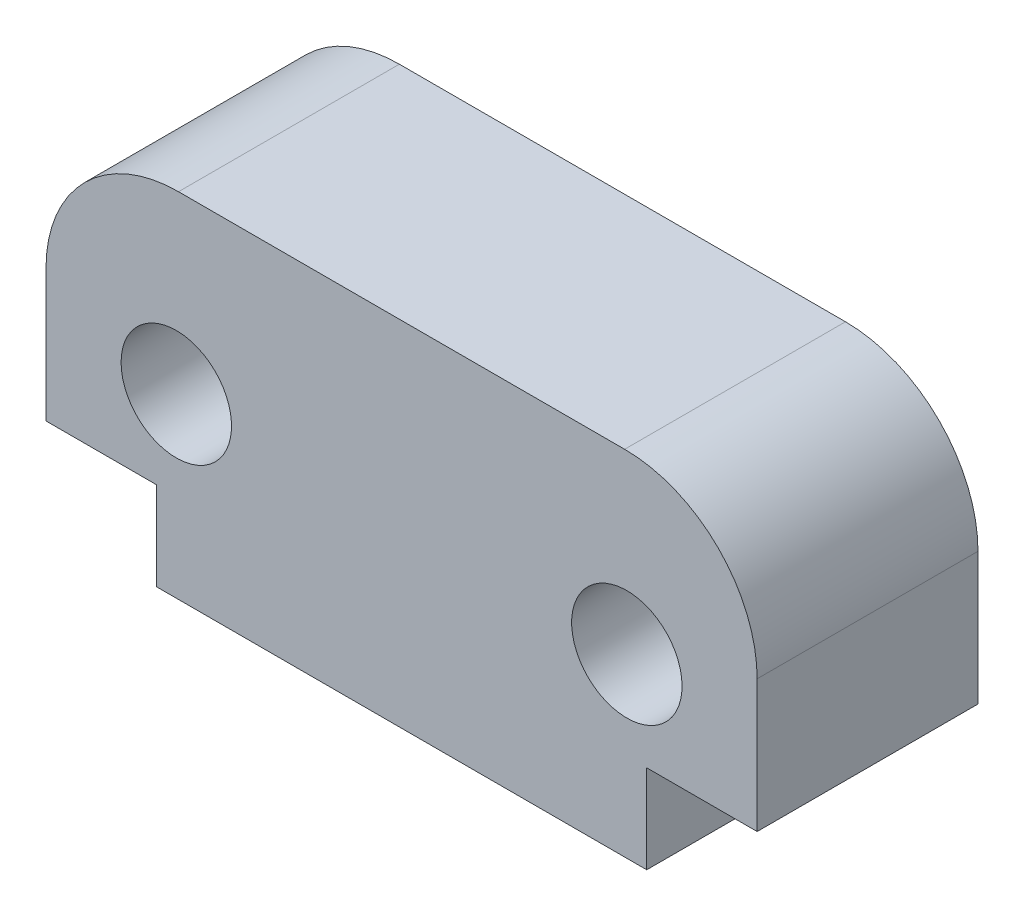
ISO-10303-21;
HEADER;
FILE_DESCRIPTION(('STEP AP214'),'2;1');
FILE_NAME('part.step','',(''),(''),'','','');
FILE_SCHEMA(('AUTOMOTIVE_DESIGN { 1 0 10303 214 1 1 1 1 }'));
ENDSEC;
DATA;
#1=APPLICATION_CONTEXT('core data for automotive mechanical design processes');
#2=APPLICATION_PROTOCOL_DEFINITION('international standard','automotive_design',2000,#1);
#3=PRODUCT_CONTEXT('',#1,'mechanical');
#4=PRODUCT('Part','Part','',(#3));
#5=PRODUCT_RELATED_PRODUCT_CATEGORY('part','',(#4));
#6=PRODUCT_DEFINITION_FORMATION('','',#4);
#7=PRODUCT_DEFINITION_CONTEXT('part definition',#1,'design');
#8=PRODUCT_DEFINITION('design','',#6,#7);
#9=PRODUCT_DEFINITION_SHAPE('','',#8);
#10=(LENGTH_UNIT() NAMED_UNIT(*) SI_UNIT(.MILLI.,.METRE.));
#11=(NAMED_UNIT(*) PLANE_ANGLE_UNIT() SI_UNIT($,.RADIAN.));
#12=(NAMED_UNIT(*) SI_UNIT($,.STERADIAN.) SOLID_ANGLE_UNIT());
#13=UNCERTAINTY_MEASURE_WITH_UNIT(LENGTH_MEASURE(1.E-05),#10,'distance_accuracy_value','');
#14=(GEOMETRIC_REPRESENTATION_CONTEXT(3) GLOBAL_UNCERTAINTY_ASSIGNED_CONTEXT((#13)) GLOBAL_UNIT_ASSIGNED_CONTEXT((#10,
#11,#12)) REPRESENTATION_CONTEXT('',''));
#15=CARTESIAN_POINT('',(0.,0.,0.));
#16=DIRECTION('',(0.,0.,1.));
#17=DIRECTION('',(1.,0.,0.));
#18=AXIS2_PLACEMENT_3D('',#15,#16,#17);
#19=CARTESIAN_POINT('',(0.500000000000054,4.99516954778732,5.));
#20=DIRECTION('',(0.,0.,-1.));
#21=DIRECTION('',(-1.,0.,0.));
#22=AXIS2_PLACEMENT_3D('',#19,#20,#21);
#23=PLANE('',#22);
#24=DIRECTION('',(0.,-1.,0.));
#25=VECTOR('',#24,1.);
#26=CARTESIAN_POINT('',(-2.49999999999995,2.00000000000051,5.));
#27=LINE('',#26,#25);
#28=CARTESIAN_POINT('',(-2.49999999999995,4.99516954778729,5.));
#29=VERTEX_POINT('',#28);
#30=CARTESIAN_POINT('',(-2.49999999999995,2.00000000000051,5.));
#31=VERTEX_POINT('',#30);
#32=EDGE_CURVE('E160',#29,#31,#27,.T.);
#33=ORIENTED_EDGE('',*,*,#32,.T.);
#34=DIRECTION('',(1.,0.,0.));
#35=VECTOR('',#34,1.);
#36=CARTESIAN_POINT('',(-4.02889527295613E-12,2.00000000000051,5.));
#37=LINE('',#36,#35);
#38=CARTESIAN_POINT('',(-4.02889527295613E-12,2.00000000000051,5.));
#39=VERTEX_POINT('',#38);
#40=EDGE_CURVE('E98',#31,#39,#37,.T.);
#41=ORIENTED_EDGE('',*,*,#40,.T.);
#42=DIRECTION('',(0.,-1.,0.));
#43=VECTOR('',#42,1.);
#44=CARTESIAN_POINT('',(-4.02889527295613E-12,2.00000000000051,5.));
#45=LINE('',#44,#43);
#46=CARTESIAN_POINT('',(-4.0286503435963E-12,-1.59594559789866E-13,5.));
#47=VERTEX_POINT('',#46);
#48=EDGE_CURVE('E181',#39,#47,#45,.T.);
#49=ORIENTED_EDGE('',*,*,#48,.T.);
#50=DIRECTION('',(1.,0.,0.));
#51=VECTOR('',#50,1.);
#52=CARTESIAN_POINT('',(-4.0286503435963E-12,-1.59594559789866E-13,5.));
#53=LINE('',#52,#51);
#54=CARTESIAN_POINT('',(11.1000000000043,-1.60798751300019E-13,5.));
#55=VERTEX_POINT('',#54);
#56=EDGE_CURVE('E200',#47,#55,#53,.T.);
#57=ORIENTED_EDGE('',*,*,#56,.T.);
#58=DIRECTION('',(0.,1.,0.));
#59=VECTOR('',#58,1.);
#60=CARTESIAN_POINT('',(11.1000000000043,2.00000000000051,5.));
#61=LINE('',#60,#59);
#62=CARTESIAN_POINT('',(11.1000000000043,2.00000000000051,5.));
#63=VERTEX_POINT('',#62);
#64=EDGE_CURVE('E197',#55,#63,#61,.T.);
#65=ORIENTED_EDGE('',*,*,#64,.T.);
#66=DIRECTION('',(1.,0.,0.));
#67=VECTOR('',#66,1.);
#68=CARTESIAN_POINT('',(11.1000000000043,2.00000000000051,5.));
#69=LINE('',#68,#67);
#70=CARTESIAN_POINT('',(13.6000000000002,2.00000000000051,5.));
#71=VERTEX_POINT('',#70);
#72=EDGE_CURVE('E199',#63,#71,#69,.T.);
#73=ORIENTED_EDGE('',*,*,#72,.T.);
#74=DIRECTION('',(0.,1.,0.));
#75=VECTOR('',#74,1.);
#76=CARTESIAN_POINT('',(13.6000000000002,2.00000000000051,5.));
#77=LINE('',#76,#75);
#78=CARTESIAN_POINT('',(13.6000000000002,4.99516954778729,5.));
#79=VERTEX_POINT('',#78);
#80=EDGE_CURVE('E123',#71,#79,#77,.T.);
#81=ORIENTED_EDGE('',*,*,#80,.T.);
#82=CARTESIAN_POINT('',(10.6000000000002,4.99516954778731,5.));
#83=DIRECTION('',(0.,0.,1.));
#84=DIRECTION('',(1.,0.,0.));
#85=AXIS2_PLACEMENT_3D('',#82,#83,#84);
#86=CIRCLE('',#85,3.);
#87=CARTESIAN_POINT('',(10.6000000000002,7.99516954778731,5.));
#88=VERTEX_POINT('',#87);
#89=EDGE_CURVE('E117',#79,#88,#86,.T.);
#90=ORIENTED_EDGE('',*,*,#89,.T.);
#91=DIRECTION('',(-1.,0.,0.));
#92=VECTOR('',#91,1.);
#93=CARTESIAN_POINT('',(0.500000000000075,7.99516954778732,5.));
#94=LINE('',#93,#92);
#95=CARTESIAN_POINT('',(0.500000000000075,7.99516954778732,5.));
#96=VERTEX_POINT('',#95);
#97=EDGE_CURVE('E121',#88,#96,#94,.T.);
#98=ORIENTED_EDGE('',*,*,#97,.T.);
#99=CARTESIAN_POINT('',(0.500000000000054,4.99516954778732,5.));
#100=DIRECTION('',(0.,0.,1.));
#101=DIRECTION('',(-1.,0.,0.));
#102=AXIS2_PLACEMENT_3D('',#99,#100,#101);
#103=CIRCLE('',#102,3.);
#104=EDGE_CURVE('E49',#96,#29,#103,.T.);
#105=ORIENTED_EDGE('',*,*,#104,.T.);
#106=EDGE_LOOP('',(#33,#41,#49,#57,#65,#73,#81,#90,#98,#105));
#107=FACE_BOUND('',#106,.T.);
#108=CARTESIAN_POINT('',(10.6500000000001,4.00000000000355,5.));
#109=DIRECTION('',(0.,0.,1.));
#110=DIRECTION('',(1.,0.,0.));
#111=AXIS2_PLACEMENT_3D('',#108,#109,#110);
#112=CIRCLE('',#111,1.25);
#113=CARTESIAN_POINT('',(11.9000000000001,4.00000000000355,5.));
#114=VERTEX_POINT('',#113);
#115=EDGE_CURVE('E145',#114,#114,#112,.T.);
#116=ORIENTED_EDGE('',*,*,#115,.F.);
#117=EDGE_LOOP('',(#116));
#118=FACE_BOUND('',#117,.T.);
#119=CARTESIAN_POINT('',(0.45000000000015,4.00000000000356,5.));
#120=DIRECTION('',(0.,0.,1.));
#121=DIRECTION('',(-1.,0.,0.));
#122=AXIS2_PLACEMENT_3D('',#119,#120,#121);
#123=CIRCLE('',#122,1.25);
#124=CARTESIAN_POINT('',(-0.799999999999853,4.00000000000356,5.));
#125=VERTEX_POINT('',#124);
#126=EDGE_CURVE('E211',#125,#125,#123,.T.);
#127=ORIENTED_EDGE('',*,*,#126,.F.);
#128=EDGE_LOOP('',(#127));
#129=FACE_BOUND('',#128,.T.);
#130=ADVANCED_FACE('F32',(#107,#118,#129),#23,.F.);
#131=CARTESIAN_POINT('',(0.500000000000054,4.99516954778732,0.));
#132=DIRECTION('',(0.,0.,-1.));
#133=DIRECTION('',(-1.,0.,0.));
#134=AXIS2_PLACEMENT_3D('',#131,#132,#133);
#135=PLANE('',#134);
#136=CARTESIAN_POINT('',(10.6500000000001,4.00000000000355,0.));
#137=DIRECTION('',(0.,0.,1.));
#138=DIRECTION('',(1.,0.,0.));
#139=AXIS2_PLACEMENT_3D('',#136,#137,#138);
#140=CIRCLE('',#139,1.25);
#141=CARTESIAN_POINT('',(11.9000000000001,4.00000000000355,0.));
#142=VERTEX_POINT('',#141);
#143=EDGE_CURVE('E208',#142,#142,#140,.T.);
#144=ORIENTED_EDGE('',*,*,#143,.T.);
#145=EDGE_LOOP('',(#144));
#146=FACE_BOUND('',#145,.T.);
#147=DIRECTION('',(0.,-1.,0.));
#148=VECTOR('',#147,1.);
#149=CARTESIAN_POINT('',(-2.49999999999995,2.00000000000051,0.));
#150=LINE('',#149,#148);
#151=CARTESIAN_POINT('',(-2.49999999999995,4.99516954778729,0.));
#152=VERTEX_POINT('',#151);
#153=CARTESIAN_POINT('',(-2.49999999999995,2.00000000000051,0.));
#154=VERTEX_POINT('',#153);
#155=EDGE_CURVE('E141',#152,#154,#150,.T.);
#156=ORIENTED_EDGE('',*,*,#155,.F.);
#157=CARTESIAN_POINT('',(0.500000000000054,4.99516954778732,0.));
#158=DIRECTION('',(0.,0.,1.));
#159=DIRECTION('',(-1.,0.,0.));
#160=AXIS2_PLACEMENT_3D('',#157,#158,#159);
#161=CIRCLE('',#160,3.);
#162=CARTESIAN_POINT('',(0.500000000000075,7.99516954778732,0.));
#163=VERTEX_POINT('',#162);
#164=EDGE_CURVE('E90',#163,#152,#161,.T.);
#165=ORIENTED_EDGE('',*,*,#164,.F.);
#166=DIRECTION('',(-1.,0.,0.));
#167=VECTOR('',#166,1.);
#168=CARTESIAN_POINT('',(0.500000000000075,7.99516954778732,0.));
#169=LINE('',#168,#167);
#170=CARTESIAN_POINT('',(10.6000000000002,7.99516954778731,0.));
#171=VERTEX_POINT('',#170);
#172=EDGE_CURVE('E84',#171,#163,#169,.T.);
#173=ORIENTED_EDGE('',*,*,#172,.F.);
#174=CARTESIAN_POINT('',(10.6000000000002,4.99516954778731,0.));
#175=DIRECTION('',(0.,0.,1.));
#176=DIRECTION('',(1.,0.,0.));
#177=AXIS2_PLACEMENT_3D('',#174,#175,#176);
#178=CIRCLE('',#177,3.);
#179=CARTESIAN_POINT('',(13.6000000000002,4.99516954778729,0.));
#180=VERTEX_POINT('',#179);
#181=EDGE_CURVE('E131',#180,#171,#178,.T.);
#182=ORIENTED_EDGE('',*,*,#181,.F.);
#183=DIRECTION('',(0.,1.,0.));
#184=VECTOR('',#183,1.);
#185=CARTESIAN_POINT('',(13.6000000000002,2.00000000000051,0.));
#186=LINE('',#185,#184);
#187=CARTESIAN_POINT('',(13.6000000000002,2.00000000000051,0.));
#188=VERTEX_POINT('',#187);
#189=EDGE_CURVE('E155',#188,#180,#186,.T.);
#190=ORIENTED_EDGE('',*,*,#189,.F.);
#191=DIRECTION('',(1.,0.,0.));
#192=VECTOR('',#191,1.);
#193=CARTESIAN_POINT('',(11.1000000000043,2.00000000000051,0.));
#194=LINE('',#193,#192);
#195=CARTESIAN_POINT('',(11.1000000000043,2.00000000000051,0.));
#196=VERTEX_POINT('',#195);
#197=EDGE_CURVE('E153',#196,#188,#194,.T.);
#198=ORIENTED_EDGE('',*,*,#197,.F.);
#199=DIRECTION('',(0.,1.,0.));
#200=VECTOR('',#199,1.);
#201=CARTESIAN_POINT('',(11.1000000000043,2.00000000000051,0.));
#202=LINE('',#201,#200);
#203=CARTESIAN_POINT('',(11.1000000000043,-1.60798751300019E-13,0.));
#204=VERTEX_POINT('',#203);
#205=EDGE_CURVE('E151',#204,#196,#202,.T.);
#206=ORIENTED_EDGE('',*,*,#205,.F.);
#207=DIRECTION('',(1.,0.,0.));
#208=VECTOR('',#207,1.);
#209=CARTESIAN_POINT('',(-4.0286503435963E-12,-1.59594559789866E-13,0.));
#210=LINE('',#209,#208);
#211=CARTESIAN_POINT('',(-4.0286503435963E-12,-1.59594559789866E-13,0.));
#212=VERTEX_POINT('',#211);
#213=EDGE_CURVE('E149',#212,#204,#210,.T.);
#214=ORIENTED_EDGE('',*,*,#213,.F.);
#215=DIRECTION('',(0.,-1.,0.));
#216=VECTOR('',#215,1.);
#217=CARTESIAN_POINT('',(-4.02889527295613E-12,2.00000000000051,0.));
#218=LINE('',#217,#216);
#219=CARTESIAN_POINT('',(-4.02889527295613E-12,2.00000000000051,0.));
#220=VERTEX_POINT('',#219);
#221=EDGE_CURVE('E147',#220,#212,#218,.T.);
#222=ORIENTED_EDGE('',*,*,#221,.F.);
#223=DIRECTION('',(1.,0.,0.));
#224=VECTOR('',#223,1.);
#225=CARTESIAN_POINT('',(-4.02889527295613E-12,2.00000000000051,0.));
#226=LINE('',#225,#224);
#227=EDGE_CURVE('E144',#154,#220,#226,.T.);
#228=ORIENTED_EDGE('',*,*,#227,.F.);
#229=EDGE_LOOP('',(#156,#165,#173,#182,#190,#198,#206,#214,#222,#228));
#230=FACE_BOUND('',#229,.T.);
#231=CARTESIAN_POINT('',(0.45000000000015,4.00000000000356,0.));
#232=DIRECTION('',(0.,0.,1.));
#233=DIRECTION('',(-1.,0.,0.));
#234=AXIS2_PLACEMENT_3D('',#231,#232,#233);
#235=CIRCLE('',#234,1.25);
#236=CARTESIAN_POINT('',(-0.799999999999853,4.00000000000356,0.));
#237=VERTEX_POINT('',#236);
#238=EDGE_CURVE('E214',#237,#237,#235,.T.);
#239=ORIENTED_EDGE('',*,*,#238,.T.);
#240=EDGE_LOOP('',(#239));
#241=FACE_BOUND('',#240,.T.);
#242=ADVANCED_FACE('F185',(#146,#230,#241),#135,.T.);
#243=CARTESIAN_POINT('',(-2.49999999999995,2.00000000000051,5.));
#244=DIRECTION('',(1.,0.,0.));
#245=DIRECTION('',(0.,0.,-1.));
#246=AXIS2_PLACEMENT_3D('',#243,#244,#245);
#247=PLANE('',#246);
#248=ORIENTED_EDGE('',*,*,#155,.T.);
#249=DIRECTION('',(0.,0.,-1.));
#250=VECTOR('',#249,1.);
#251=CARTESIAN_POINT('',(-2.49999999999995,2.00000000000051,5.));
#252=LINE('',#251,#250);
#253=EDGE_CURVE('E11',#31,#154,#252,.T.);
#254=ORIENTED_EDGE('',*,*,#253,.F.);
#255=ORIENTED_EDGE('',*,*,#32,.F.);
#256=DIRECTION('',(0.,0.,-1.));
#257=VECTOR('',#256,1.);
#258=CARTESIAN_POINT('',(-2.49999999999995,4.99516954778729,5.));
#259=LINE('',#258,#257);
#260=EDGE_CURVE('E137',#29,#152,#259,.T.);
#261=ORIENTED_EDGE('',*,*,#260,.T.);
#262=EDGE_LOOP('',(#248,#254,#255,#261));
#263=FACE_BOUND('',#262,.T.);
#264=ADVANCED_FACE('F34',(#263),#247,.F.);
#265=CARTESIAN_POINT('',(-4.02889527295613E-12,2.00000000000051,5.));
#266=DIRECTION('',(0.,1.,0.));
#267=DIRECTION('',(-1.,0.,0.));
#268=AXIS2_PLACEMENT_3D('',#265,#266,#267);
#269=PLANE('',#268);
#270=ORIENTED_EDGE('',*,*,#227,.T.);
#271=DIRECTION('',(0.,0.,-1.));
#272=VECTOR('',#271,1.);
#273=CARTESIAN_POINT('',(-4.02889527295613E-12,2.00000000000051,5.));
#274=LINE('',#273,#272);
#275=EDGE_CURVE('E41',#39,#220,#274,.T.);
#276=ORIENTED_EDGE('',*,*,#275,.F.);
#277=ORIENTED_EDGE('',*,*,#40,.F.);
#278=ORIENTED_EDGE('',*,*,#253,.T.);
#279=EDGE_LOOP('',(#270,#276,#277,#278));
#280=FACE_BOUND('',#279,.T.);
#281=ADVANCED_FACE('F254',(#280),#269,.F.);
#282=CARTESIAN_POINT('',(-4.02889527295613E-12,2.00000000000051,5.));
#283=DIRECTION('',(1.,0.,0.));
#284=DIRECTION('',(0.,1.,0.));
#285=AXIS2_PLACEMENT_3D('',#282,#283,#284);
#286=PLANE('',#285);
#287=ORIENTED_EDGE('',*,*,#221,.T.);
#288=DIRECTION('',(0.,0.,-1.));
#289=VECTOR('',#288,1.);
#290=CARTESIAN_POINT('',(-4.0286503435963E-12,-1.59594559789866E-13,5.));
#291=LINE('',#290,#289);
#292=EDGE_CURVE('E173',#47,#212,#291,.T.);
#293=ORIENTED_EDGE('',*,*,#292,.F.);
#294=ORIENTED_EDGE('',*,*,#48,.F.);
#295=ORIENTED_EDGE('',*,*,#275,.T.);
#296=EDGE_LOOP('',(#287,#293,#294,#295));
#297=FACE_BOUND('',#296,.T.);
#298=ADVANCED_FACE('F179',(#297),#286,.F.);
#299=CARTESIAN_POINT('',(-4.0286503435963E-12,-1.59594559789866E-13,5.));
#300=DIRECTION('',(0.,1.,0.));
#301=DIRECTION('',(-1.,0.,0.));
#302=AXIS2_PLACEMENT_3D('',#299,#300,#301);
#303=PLANE('',#302);
#304=ORIENTED_EDGE('',*,*,#213,.T.);
#305=DIRECTION('',(0.,0.,-1.));
#306=VECTOR('',#305,1.);
#307=CARTESIAN_POINT('',(11.1000000000043,-1.60798751300019E-13,5.));
#308=LINE('',#307,#306);
#309=EDGE_CURVE('E170',#55,#204,#308,.T.);
#310=ORIENTED_EDGE('',*,*,#309,.F.);
#311=ORIENTED_EDGE('',*,*,#56,.F.);
#312=ORIENTED_EDGE('',*,*,#292,.T.);
#313=EDGE_LOOP('',(#304,#310,#311,#312));
#314=FACE_BOUND('',#313,.T.);
#315=ADVANCED_FACE('F191',(#314),#303,.F.);
#316=CARTESIAN_POINT('',(11.1000000000043,2.00000000000051,5.));
#317=DIRECTION('',(-1.,0.,0.));
#318=DIRECTION('',(0.,0.,1.));
#319=AXIS2_PLACEMENT_3D('',#316,#317,#318);
#320=PLANE('',#319);
#321=ORIENTED_EDGE('',*,*,#205,.T.);
#322=DIRECTION('',(0.,0.,-1.));
#323=VECTOR('',#322,1.);
#324=CARTESIAN_POINT('',(11.1000000000043,2.00000000000051,5.));
#325=LINE('',#324,#323);
#326=EDGE_CURVE('E167',#63,#196,#325,.T.);
#327=ORIENTED_EDGE('',*,*,#326,.F.);
#328=ORIENTED_EDGE('',*,*,#64,.F.);
#329=ORIENTED_EDGE('',*,*,#309,.T.);
#330=EDGE_LOOP('',(#321,#327,#328,#329));
#331=FACE_BOUND('',#330,.T.);
#332=ADVANCED_FACE('F195',(#331),#320,.F.);
#333=CARTESIAN_POINT('',(11.1000000000043,2.00000000000051,5.));
#334=DIRECTION('',(0.,1.,0.));
#335=DIRECTION('',(-1.,0.,0.));
#336=AXIS2_PLACEMENT_3D('',#333,#334,#335);
#337=PLANE('',#336);
#338=ORIENTED_EDGE('',*,*,#197,.T.);
#339=DIRECTION('',(0.,0.,-1.));
#340=VECTOR('',#339,1.);
#341=CARTESIAN_POINT('',(13.6000000000002,2.00000000000051,5.));
#342=LINE('',#341,#340);
#343=EDGE_CURVE('E164',#71,#188,#342,.T.);
#344=ORIENTED_EDGE('',*,*,#343,.F.);
#345=ORIENTED_EDGE('',*,*,#72,.F.);
#346=ORIENTED_EDGE('',*,*,#326,.T.);
#347=EDGE_LOOP('',(#338,#344,#345,#346));
#348=FACE_BOUND('',#347,.T.);
#349=ADVANCED_FACE('F244',(#348),#337,.F.);
#350=CARTESIAN_POINT('',(13.6000000000002,2.00000000000051,5.));
#351=DIRECTION('',(-1.,0.,0.));
#352=DIRECTION('',(0.,0.,1.));
#353=AXIS2_PLACEMENT_3D('',#350,#351,#352);
#354=PLANE('',#353);
#355=ORIENTED_EDGE('',*,*,#189,.T.);
#356=DIRECTION('',(0.,0.,-1.));
#357=VECTOR('',#356,1.);
#358=CARTESIAN_POINT('',(13.6000000000002,4.99516954778729,5.));
#359=LINE('',#358,#357);
#360=EDGE_CURVE('E132',#79,#180,#359,.T.);
#361=ORIENTED_EDGE('',*,*,#360,.F.);
#362=ORIENTED_EDGE('',*,*,#80,.F.);
#363=ORIENTED_EDGE('',*,*,#343,.T.);
#364=EDGE_LOOP('',(#355,#361,#362,#363));
#365=FACE_BOUND('',#364,.T.);
#366=ADVANCED_FACE('F241',(#365),#354,.F.);
#367=CARTESIAN_POINT('',(10.6000000000002,4.99516954778731,5.));
#368=DIRECTION('',(0.,0.,-1.));
#369=DIRECTION('',(-1.,0.,0.));
#370=AXIS2_PLACEMENT_3D('',#367,#368,#369);
#371=CYLINDRICAL_SURFACE('',#370,3.);
#372=ORIENTED_EDGE('',*,*,#181,.T.);
#373=DIRECTION('',(0.,0.,-1.));
#374=VECTOR('',#373,1.);
#375=CARTESIAN_POINT('',(10.6000000000002,7.99516954778731,5.));
#376=LINE('',#375,#374);
#377=EDGE_CURVE('E128',#88,#171,#376,.T.);
#378=ORIENTED_EDGE('',*,*,#377,.F.);
#379=ORIENTED_EDGE('',*,*,#89,.F.);
#380=ORIENTED_EDGE('',*,*,#360,.T.);
#381=EDGE_LOOP('',(#372,#378,#379,#380));
#382=FACE_BOUND('',#381,.T.);
#383=ADVANCED_FACE('F129',(#382),#371,.T.);
#384=CARTESIAN_POINT('',(0.500000000000075,7.99516954778732,5.));
#385=DIRECTION('',(0.,-1.,0.));
#386=DIRECTION('',(0.,0.,-1.));
#387=AXIS2_PLACEMENT_3D('',#384,#385,#386);
#388=PLANE('',#387);
#389=ORIENTED_EDGE('',*,*,#172,.T.);
#390=DIRECTION('',(0.,0.,-1.));
#391=VECTOR('',#390,1.);
#392=CARTESIAN_POINT('',(0.500000000000075,7.99516954778732,5.));
#393=LINE('',#392,#391);
#394=EDGE_CURVE('E133',#96,#163,#393,.T.);
#395=ORIENTED_EDGE('',*,*,#394,.F.);
#396=ORIENTED_EDGE('',*,*,#97,.F.);
#397=ORIENTED_EDGE('',*,*,#377,.T.);
#398=EDGE_LOOP('',(#389,#395,#396,#397));
#399=FACE_BOUND('',#398,.T.);
#400=ADVANCED_FACE('F135',(#399),#388,.F.);
#401=CARTESIAN_POINT('',(0.500000000000054,4.99516954778732,5.));
#402=DIRECTION('',(0.,0.,-1.));
#403=DIRECTION('',(-1.,0.,0.));
#404=AXIS2_PLACEMENT_3D('',#401,#402,#403);
#405=CYLINDRICAL_SURFACE('',#404,3.);
#406=ORIENTED_EDGE('',*,*,#164,.T.);
#407=ORIENTED_EDGE('',*,*,#260,.F.);
#408=ORIENTED_EDGE('',*,*,#104,.F.);
#409=ORIENTED_EDGE('',*,*,#394,.T.);
#410=EDGE_LOOP('',(#406,#407,#408,#409));
#411=FACE_BOUND('',#410,.T.);
#412=ADVANCED_FACE('F234',(#411),#405,.T.);
#413=CARTESIAN_POINT('',(10.6500000000001,4.00000000000355,5.));
#414=DIRECTION('',(0.,0.,-1.));
#415=DIRECTION('',(-1.,0.,0.));
#416=AXIS2_PLACEMENT_3D('',#413,#414,#415);
#417=CYLINDRICAL_SURFACE('',#416,1.25);
#418=ORIENTED_EDGE('',*,*,#115,.T.);
#419=EDGE_LOOP('',(#418));
#420=FACE_BOUND('',#419,.T.);
#421=ORIENTED_EDGE('',*,*,#143,.F.);
#422=EDGE_LOOP('',(#421));
#423=FACE_BOUND('',#422,.T.);
#424=ADVANCED_FACE('F231',(#420,#423),#417,.F.);
#425=CARTESIAN_POINT('',(0.45000000000015,4.00000000000356,5.));
#426=DIRECTION('',(0.,0.,-1.));
#427=DIRECTION('',(-1.,0.,0.));
#428=AXIS2_PLACEMENT_3D('',#425,#426,#427);
#429=CYLINDRICAL_SURFACE('',#428,1.25);
#430=ORIENTED_EDGE('',*,*,#126,.T.);
#431=EDGE_LOOP('',(#430));
#432=FACE_BOUND('',#431,.T.);
#433=ORIENTED_EDGE('',*,*,#238,.F.);
#434=EDGE_LOOP('',(#433));
#435=FACE_BOUND('',#434,.T.);
#436=ADVANCED_FACE('F220',(#432,#435),#429,.F.);
#437=CLOSED_SHELL('',(#130,#242,#264,#281,#298,#315,#332,#349,#366,#383,#400,#412,#424,#436));
#438=MANIFOLD_SOLID_BREP('B2',#437);
#439=ADVANCED_BREP_SHAPE_REPRESENTATION('',(#18,#438),#14);
#440=SHAPE_DEFINITION_REPRESENTATION(#9,#439);
ENDSEC;
END-ISO-10303-21;
